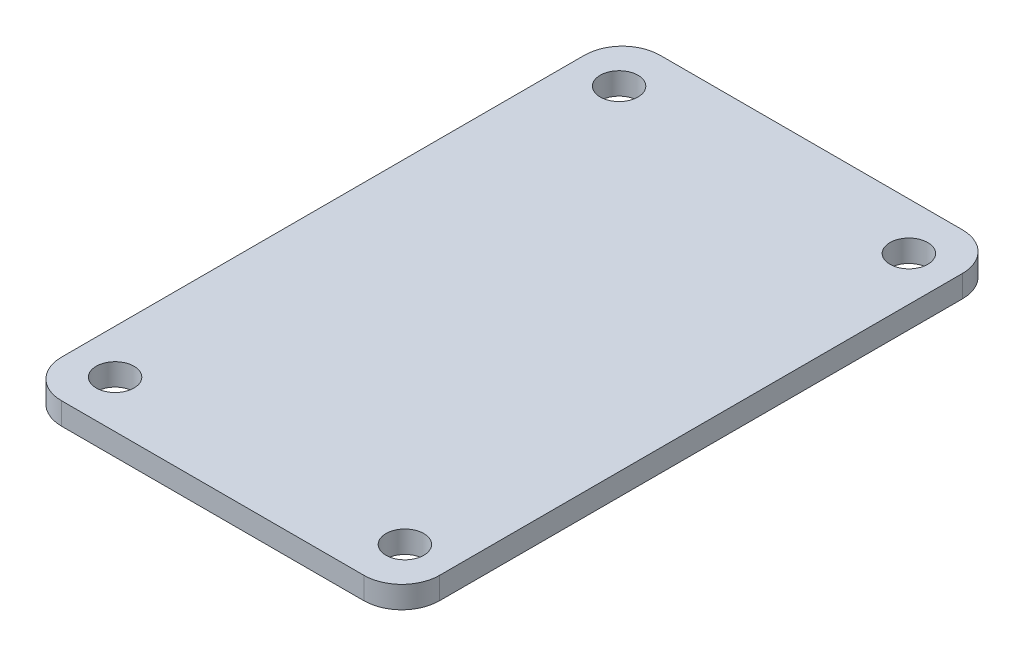
ISO-10303-21;
HEADER;
FILE_DESCRIPTION(('STEP AP214'),'2;1');
FILE_NAME('part.step','',(''),(''),'','','');
FILE_SCHEMA(('AUTOMOTIVE_DESIGN { 1 0 10303 214 1 1 1 1 }'));
ENDSEC;
DATA;
#1=APPLICATION_CONTEXT('core data for automotive mechanical design processes');
#2=APPLICATION_PROTOCOL_DEFINITION('international standard','automotive_design',2000,#1);
#3=PRODUCT_CONTEXT('',#1,'mechanical');
#4=PRODUCT('Part','Part','',(#3));
#5=PRODUCT_RELATED_PRODUCT_CATEGORY('part','',(#4));
#6=PRODUCT_DEFINITION_FORMATION('','',#4);
#7=PRODUCT_DEFINITION_CONTEXT('part definition',#1,'design');
#8=PRODUCT_DEFINITION('design','',#6,#7);
#9=PRODUCT_DEFINITION_SHAPE('','',#8);
#10=(LENGTH_UNIT() NAMED_UNIT(*) SI_UNIT(.MILLI.,.METRE.));
#11=(NAMED_UNIT(*) PLANE_ANGLE_UNIT() SI_UNIT($,.RADIAN.));
#12=(NAMED_UNIT(*) SI_UNIT($,.STERADIAN.) SOLID_ANGLE_UNIT());
#13=UNCERTAINTY_MEASURE_WITH_UNIT(LENGTH_MEASURE(1.E-05),#10,'distance_accuracy_value','');
#14=(GEOMETRIC_REPRESENTATION_CONTEXT(3) GLOBAL_UNCERTAINTY_ASSIGNED_CONTEXT((#13)) GLOBAL_UNIT_ASSIGNED_CONTEXT((#10,
#11,#12)) REPRESENTATION_CONTEXT('',''));
#15=CARTESIAN_POINT('',(0.,0.,0.));
#16=DIRECTION('',(0.,0.,1.));
#17=DIRECTION('',(1.,0.,0.));
#18=AXIS2_PLACEMENT_3D('',#15,#16,#17);
#19=CARTESIAN_POINT('',(-12.,1.75,20.75));
#20=DIRECTION('',(0.,1.,0.));
#21=DIRECTION('',(0.,0.,1.));
#22=AXIS2_PLACEMENT_3D('',#19,#20,#21);
#23=PLANE('',#22);
#24=CARTESIAN_POINT('',(11.5,1.75,20.));
#25=DIRECTION('',(0.,1.,0.));
#26=DIRECTION('',(0.,0.,1.));
#27=AXIS2_PLACEMENT_3D('',#24,#25,#26);
#28=CIRCLE('',#27,1.5);
#29=CARTESIAN_POINT('',(11.5,1.75,21.5));
#30=VERTEX_POINT('',#29);
#31=EDGE_CURVE('E227',#30,#30,#28,.T.);
#32=ORIENTED_EDGE('',*,*,#31,.F.);
#33=EDGE_LOOP('',(#32));
#34=FACE_BOUND('',#33,.T.);
#35=CARTESIAN_POINT('',(-11.5,1.75,-20.));
#36=DIRECTION('',(0.,1.,0.));
#37=DIRECTION('',(0.,0.,1.));
#38=AXIS2_PLACEMENT_3D('',#35,#36,#37);
#39=CIRCLE('',#38,1.5);
#40=CARTESIAN_POINT('',(-11.5,1.75,-18.5));
#41=VERTEX_POINT('',#40);
#42=EDGE_CURVE('E152',#41,#41,#39,.T.);
#43=ORIENTED_EDGE('',*,*,#42,.F.);
#44=EDGE_LOOP('',(#43));
#45=FACE_BOUND('',#44,.T.);
#46=CARTESIAN_POINT('',(-12.,1.75,20.75));
#47=DIRECTION('',(0.,1.,0.));
#48=DIRECTION('',(0.,0.,1.));
#49=AXIS2_PLACEMENT_3D('',#46,#47,#48);
#50=CIRCLE('',#49,3.);
#51=CARTESIAN_POINT('',(-15.,1.75,20.75));
#52=VERTEX_POINT('',#51);
#53=CARTESIAN_POINT('',(-12.,1.75,23.75));
#54=VERTEX_POINT('',#53);
#55=EDGE_CURVE('E170',#52,#54,#50,.T.);
#56=ORIENTED_EDGE('',*,*,#55,.T.);
#57=DIRECTION('',(1.,0.,0.));
#58=VECTOR('',#57,1.);
#59=CARTESIAN_POINT('',(-12.,1.75,23.75));
#60=LINE('',#59,#58);
#61=CARTESIAN_POINT('',(12.,1.75,23.75));
#62=VERTEX_POINT('',#61);
#63=EDGE_CURVE('E106',#54,#62,#60,.T.);
#64=ORIENTED_EDGE('',*,*,#63,.T.);
#65=CARTESIAN_POINT('',(12.,1.75,20.75));
#66=DIRECTION('',(0.,1.,0.));
#67=DIRECTION('',(0.,0.,1.));
#68=AXIS2_PLACEMENT_3D('',#65,#66,#67);
#69=CIRCLE('',#68,3.);
#70=CARTESIAN_POINT('',(15.,1.75,20.75));
#71=VERTEX_POINT('',#70);
#72=EDGE_CURVE('E191',#62,#71,#69,.T.);
#73=ORIENTED_EDGE('',*,*,#72,.T.);
#74=DIRECTION('',(0.,0.,-1.));
#75=VECTOR('',#74,1.);
#76=CARTESIAN_POINT('',(15.,1.75,20.75));
#77=LINE('',#76,#75);
#78=CARTESIAN_POINT('',(15.,1.75,-20.75));
#79=VERTEX_POINT('',#78);
#80=EDGE_CURVE('E205',#71,#79,#77,.T.);
#81=ORIENTED_EDGE('',*,*,#80,.T.);
#82=CARTESIAN_POINT('',(12.,1.75,-20.75));
#83=DIRECTION('',(0.,1.,0.));
#84=DIRECTION('',(0.,0.,1.));
#85=AXIS2_PLACEMENT_3D('',#82,#83,#84);
#86=CIRCLE('',#85,3.);
#87=CARTESIAN_POINT('',(12.,1.75,-23.75));
#88=VERTEX_POINT('',#87);
#89=EDGE_CURVE('E125',#79,#88,#86,.T.);
#90=ORIENTED_EDGE('',*,*,#89,.T.);
#91=DIRECTION('',(-1.,0.,0.));
#92=VECTOR('',#91,1.);
#93=CARTESIAN_POINT('',(-12.,1.75,-23.75));
#94=LINE('',#93,#92);
#95=CARTESIAN_POINT('',(-12.,1.75,-23.75));
#96=VERTEX_POINT('',#95);
#97=EDGE_CURVE('E119',#88,#96,#94,.T.);
#98=ORIENTED_EDGE('',*,*,#97,.T.);
#99=CARTESIAN_POINT('',(-12.,1.75,-20.75));
#100=DIRECTION('',(0.,1.,0.));
#101=DIRECTION('',(0.,0.,1.));
#102=AXIS2_PLACEMENT_3D('',#99,#100,#101);
#103=CIRCLE('',#102,3.);
#104=CARTESIAN_POINT('',(-15.,1.75,-20.75));
#105=VERTEX_POINT('',#104);
#106=EDGE_CURVE('E123',#96,#105,#103,.T.);
#107=ORIENTED_EDGE('',*,*,#106,.T.);
#108=DIRECTION('',(0.,0.,1.));
#109=VECTOR('',#108,1.);
#110=CARTESIAN_POINT('',(-15.,1.75,20.75));
#111=LINE('',#110,#109);
#112=EDGE_CURVE('E63',#105,#52,#111,.T.);
#113=ORIENTED_EDGE('',*,*,#112,.T.);
#114=EDGE_LOOP('',(#56,#64,#73,#81,#90,#98,#107,#113));
#115=FACE_BOUND('',#114,.T.);
#116=CARTESIAN_POINT('',(11.5,1.75,-20.));
#117=DIRECTION('',(0.,1.,0.));
#118=DIRECTION('',(0.,0.,1.));
#119=AXIS2_PLACEMENT_3D('',#116,#117,#118);
#120=CIRCLE('',#119,1.5);
#121=CARTESIAN_POINT('',(11.5,1.75,-18.5));
#122=VERTEX_POINT('',#121);
#123=EDGE_CURVE('E219',#122,#122,#120,.T.);
#124=ORIENTED_EDGE('',*,*,#123,.F.);
#125=EDGE_LOOP('',(#124));
#126=FACE_BOUND('',#125,.T.);
#127=CARTESIAN_POINT('',(-11.5,1.75,20.));
#128=DIRECTION('',(0.,1.,0.));
#129=DIRECTION('',(0.,0.,1.));
#130=AXIS2_PLACEMENT_3D('',#127,#128,#129);
#131=CIRCLE('',#130,1.5);
#132=CARTESIAN_POINT('',(-11.5,1.75,21.5));
#133=VERTEX_POINT('',#132);
#134=EDGE_CURVE('E235',#133,#133,#131,.T.);
#135=ORIENTED_EDGE('',*,*,#134,.F.);
#136=EDGE_LOOP('',(#135));
#137=FACE_BOUND('',#136,.T.);
#138=ADVANCED_FACE('F45',(#34,#45,#115,#126,#137),#23,.T.);
#139=CARTESIAN_POINT('',(-12.,0.,20.75));
#140=DIRECTION('',(0.,1.,0.));
#141=DIRECTION('',(0.,0.,1.));
#142=AXIS2_PLACEMENT_3D('',#139,#140,#141);
#143=PLANE('',#142);
#144=CARTESIAN_POINT('',(-12.,0.,20.75));
#145=DIRECTION('',(0.,1.,0.));
#146=DIRECTION('',(0.,0.,1.));
#147=AXIS2_PLACEMENT_3D('',#144,#145,#146);
#148=CIRCLE('',#147,3.);
#149=CARTESIAN_POINT('',(-15.,0.,20.75));
#150=VERTEX_POINT('',#149);
#151=CARTESIAN_POINT('',(-12.,0.,23.75));
#152=VERTEX_POINT('',#151);
#153=EDGE_CURVE('E147',#150,#152,#148,.T.);
#154=ORIENTED_EDGE('',*,*,#153,.F.);
#155=DIRECTION('',(0.,0.,1.));
#156=VECTOR('',#155,1.);
#157=CARTESIAN_POINT('',(-15.,0.,20.75));
#158=LINE('',#157,#156);
#159=CARTESIAN_POINT('',(-15.,0.,-20.75));
#160=VERTEX_POINT('',#159);
#161=EDGE_CURVE('E98',#160,#150,#158,.T.);
#162=ORIENTED_EDGE('',*,*,#161,.F.);
#163=CARTESIAN_POINT('',(-12.,0.,-20.75));
#164=DIRECTION('',(0.,1.,0.));
#165=DIRECTION('',(0.,0.,1.));
#166=AXIS2_PLACEMENT_3D('',#163,#164,#165);
#167=CIRCLE('',#166,3.);
#168=CARTESIAN_POINT('',(-12.,0.,-23.75));
#169=VERTEX_POINT('',#168);
#170=EDGE_CURVE('E92',#169,#160,#167,.T.);
#171=ORIENTED_EDGE('',*,*,#170,.F.);
#172=DIRECTION('',(-1.,0.,0.));
#173=VECTOR('',#172,1.);
#174=CARTESIAN_POINT('',(-12.,0.,-23.75));
#175=LINE('',#174,#173);
#176=CARTESIAN_POINT('',(12.,0.,-23.75));
#177=VERTEX_POINT('',#176);
#178=EDGE_CURVE('E134',#177,#169,#175,.T.);
#179=ORIENTED_EDGE('',*,*,#178,.F.);
#180=CARTESIAN_POINT('',(12.,0.,-20.75));
#181=DIRECTION('',(0.,1.,0.));
#182=DIRECTION('',(0.,0.,1.));
#183=AXIS2_PLACEMENT_3D('',#180,#181,#182);
#184=CIRCLE('',#183,3.);
#185=CARTESIAN_POINT('',(15.,0.,-20.75));
#186=VERTEX_POINT('',#185);
#187=EDGE_CURVE('E161',#186,#177,#184,.T.);
#188=ORIENTED_EDGE('',*,*,#187,.F.);
#189=DIRECTION('',(0.,0.,-1.));
#190=VECTOR('',#189,1.);
#191=CARTESIAN_POINT('',(15.,0.,20.75));
#192=LINE('',#191,#190);
#193=CARTESIAN_POINT('',(15.,0.,20.75));
#194=VERTEX_POINT('',#193);
#195=EDGE_CURVE('E158',#194,#186,#192,.T.);
#196=ORIENTED_EDGE('',*,*,#195,.F.);
#197=CARTESIAN_POINT('',(12.,0.,20.75));
#198=DIRECTION('',(0.,1.,0.));
#199=DIRECTION('',(0.,0.,1.));
#200=AXIS2_PLACEMENT_3D('',#197,#198,#199);
#201=CIRCLE('',#200,3.);
#202=CARTESIAN_POINT('',(12.,0.,23.75));
#203=VERTEX_POINT('',#202);
#204=EDGE_CURVE('E155',#203,#194,#201,.T.);
#205=ORIENTED_EDGE('',*,*,#204,.F.);
#206=DIRECTION('',(1.,0.,0.));
#207=VECTOR('',#206,1.);
#208=CARTESIAN_POINT('',(-12.,0.,23.75));
#209=LINE('',#208,#207);
#210=EDGE_CURVE('E151',#152,#203,#209,.T.);
#211=ORIENTED_EDGE('',*,*,#210,.F.);
#212=EDGE_LOOP('',(#154,#162,#171,#179,#188,#196,#205,#211));
#213=FACE_BOUND('',#212,.T.);
#214=CARTESIAN_POINT('',(-11.5,0.,-20.));
#215=DIRECTION('',(0.,1.,0.));
#216=DIRECTION('',(0.,0.,1.));
#217=AXIS2_PLACEMENT_3D('',#214,#215,#216);
#218=CIRCLE('',#217,1.5);
#219=CARTESIAN_POINT('',(-11.5,0.,-18.5));
#220=VERTEX_POINT('',#219);
#221=EDGE_CURVE('E215',#220,#220,#218,.T.);
#222=ORIENTED_EDGE('',*,*,#221,.T.);
#223=EDGE_LOOP('',(#222));
#224=FACE_BOUND('',#223,.T.);
#225=CARTESIAN_POINT('',(11.5,0.,-20.));
#226=DIRECTION('',(0.,1.,0.));
#227=DIRECTION('',(0.,0.,1.));
#228=AXIS2_PLACEMENT_3D('',#225,#226,#227);
#229=CIRCLE('',#228,1.5);
#230=CARTESIAN_POINT('',(11.5,0.,-18.5));
#231=VERTEX_POINT('',#230);
#232=EDGE_CURVE('E223',#231,#231,#229,.T.);
#233=ORIENTED_EDGE('',*,*,#232,.T.);
#234=EDGE_LOOP('',(#233));
#235=FACE_BOUND('',#234,.T.);
#236=CARTESIAN_POINT('',(11.5,0.,20.));
#237=DIRECTION('',(0.,1.,0.));
#238=DIRECTION('',(0.,0.,1.));
#239=AXIS2_PLACEMENT_3D('',#236,#237,#238);
#240=CIRCLE('',#239,1.5);
#241=CARTESIAN_POINT('',(11.5,0.,21.5));
#242=VERTEX_POINT('',#241);
#243=EDGE_CURVE('E231',#242,#242,#240,.T.);
#244=ORIENTED_EDGE('',*,*,#243,.T.);
#245=EDGE_LOOP('',(#244));
#246=FACE_BOUND('',#245,.T.);
#247=CARTESIAN_POINT('',(-11.5,0.,20.));
#248=DIRECTION('',(0.,1.,0.));
#249=DIRECTION('',(0.,0.,1.));
#250=AXIS2_PLACEMENT_3D('',#247,#248,#249);
#251=CIRCLE('',#250,1.5);
#252=CARTESIAN_POINT('',(-11.5,0.,21.5));
#253=VERTEX_POINT('',#252);
#254=EDGE_CURVE('E239',#253,#253,#251,.T.);
#255=ORIENTED_EDGE('',*,*,#254,.T.);
#256=EDGE_LOOP('',(#255));
#257=FACE_BOUND('',#256,.T.);
#258=ADVANCED_FACE('F195',(#213,#224,#235,#246,#257),#143,.F.);
#259=CARTESIAN_POINT('',(-12.,1.75,20.75));
#260=DIRECTION('',(0.,-1.,0.));
#261=DIRECTION('',(0.,0.,-1.));
#262=AXIS2_PLACEMENT_3D('',#259,#260,#261);
#263=CYLINDRICAL_SURFACE('',#262,3.);
#264=ORIENTED_EDGE('',*,*,#153,.T.);
#265=DIRECTION('',(0.,-1.,0.));
#266=VECTOR('',#265,1.);
#267=CARTESIAN_POINT('',(-12.,1.75,23.75));
#268=LINE('',#267,#266);
#269=EDGE_CURVE('E11',#54,#152,#268,.T.);
#270=ORIENTED_EDGE('',*,*,#269,.F.);
#271=ORIENTED_EDGE('',*,*,#55,.F.);
#272=DIRECTION('',(0.,-1.,0.));
#273=VECTOR('',#272,1.);
#274=CARTESIAN_POINT('',(-15.,1.75,20.75));
#275=LINE('',#274,#273);
#276=EDGE_CURVE('E143',#52,#150,#275,.T.);
#277=ORIENTED_EDGE('',*,*,#276,.T.);
#278=EDGE_LOOP('',(#264,#270,#271,#277));
#279=FACE_BOUND('',#278,.T.);
#280=ADVANCED_FACE('F47',(#279),#263,.T.);
#281=CARTESIAN_POINT('',(-12.,1.75,23.75));
#282=DIRECTION('',(0.,0.,-1.));
#283=DIRECTION('',(-1.,0.,0.));
#284=AXIS2_PLACEMENT_3D('',#281,#282,#283);
#285=PLANE('',#284);
#286=ORIENTED_EDGE('',*,*,#210,.T.);
#287=DIRECTION('',(0.,-1.,0.));
#288=VECTOR('',#287,1.);
#289=CARTESIAN_POINT('',(12.,1.75,23.75));
#290=LINE('',#289,#288);
#291=EDGE_CURVE('E55',#62,#203,#290,.T.);
#292=ORIENTED_EDGE('',*,*,#291,.F.);
#293=ORIENTED_EDGE('',*,*,#63,.F.);
#294=ORIENTED_EDGE('',*,*,#269,.T.);
#295=EDGE_LOOP('',(#286,#292,#293,#294));
#296=FACE_BOUND('',#295,.T.);
#297=ADVANCED_FACE('F275',(#296),#285,.F.);
#298=CARTESIAN_POINT('',(12.,1.75,20.75));
#299=DIRECTION('',(0.,-1.,0.));
#300=DIRECTION('',(0.,0.,-1.));
#301=AXIS2_PLACEMENT_3D('',#298,#299,#300);
#302=CYLINDRICAL_SURFACE('',#301,3.);
#303=ORIENTED_EDGE('',*,*,#204,.T.);
#304=DIRECTION('',(0.,-1.,0.));
#305=VECTOR('',#304,1.);
#306=CARTESIAN_POINT('',(15.,1.75,20.75));
#307=LINE('',#306,#305);
#308=EDGE_CURVE('E181',#71,#194,#307,.T.);
#309=ORIENTED_EDGE('',*,*,#308,.F.);
#310=ORIENTED_EDGE('',*,*,#72,.F.);
#311=ORIENTED_EDGE('',*,*,#291,.T.);
#312=EDGE_LOOP('',(#303,#309,#310,#311));
#313=FACE_BOUND('',#312,.T.);
#314=ADVANCED_FACE('F189',(#313),#302,.T.);
#315=CARTESIAN_POINT('',(15.,1.75,20.75));
#316=DIRECTION('',(-1.,0.,0.));
#317=DIRECTION('',(0.,0.,1.));
#318=AXIS2_PLACEMENT_3D('',#315,#316,#317);
#319=PLANE('',#318);
#320=ORIENTED_EDGE('',*,*,#195,.T.);
#321=DIRECTION('',(0.,-1.,0.));
#322=VECTOR('',#321,1.);
#323=CARTESIAN_POINT('',(15.,1.75,-20.75));
#324=LINE('',#323,#322);
#325=EDGE_CURVE('E177',#79,#186,#324,.T.);
#326=ORIENTED_EDGE('',*,*,#325,.F.);
#327=ORIENTED_EDGE('',*,*,#80,.F.);
#328=ORIENTED_EDGE('',*,*,#308,.T.);
#329=EDGE_LOOP('',(#320,#326,#327,#328));
#330=FACE_BOUND('',#329,.T.);
#331=ADVANCED_FACE('F200',(#330),#319,.F.);
#332=CARTESIAN_POINT('',(12.,1.75,-20.75));
#333=DIRECTION('',(0.,-1.,0.));
#334=DIRECTION('',(0.,0.,-1.));
#335=AXIS2_PLACEMENT_3D('',#332,#333,#334);
#336=CYLINDRICAL_SURFACE('',#335,3.);
#337=ORIENTED_EDGE('',*,*,#187,.T.);
#338=DIRECTION('',(0.,-1.,0.));
#339=VECTOR('',#338,1.);
#340=CARTESIAN_POINT('',(12.,1.75,-23.75));
#341=LINE('',#340,#339);
#342=EDGE_CURVE('E136',#88,#177,#341,.T.);
#343=ORIENTED_EDGE('',*,*,#342,.F.);
#344=ORIENTED_EDGE('',*,*,#89,.F.);
#345=ORIENTED_EDGE('',*,*,#325,.T.);
#346=EDGE_LOOP('',(#337,#343,#344,#345));
#347=FACE_BOUND('',#346,.T.);
#348=ADVANCED_FACE('F203',(#347),#336,.T.);
#349=CARTESIAN_POINT('',(-12.,1.75,-23.75));
#350=DIRECTION('',(0.,0.,1.));
#351=DIRECTION('',(1.,0.,0.));
#352=AXIS2_PLACEMENT_3D('',#349,#350,#351);
#353=PLANE('',#352);
#354=ORIENTED_EDGE('',*,*,#178,.T.);
#355=DIRECTION('',(0.,-1.,0.));
#356=VECTOR('',#355,1.);
#357=CARTESIAN_POINT('',(-12.,1.75,-23.75));
#358=LINE('',#357,#356);
#359=EDGE_CURVE('E131',#96,#169,#358,.T.);
#360=ORIENTED_EDGE('',*,*,#359,.F.);
#361=ORIENTED_EDGE('',*,*,#97,.F.);
#362=ORIENTED_EDGE('',*,*,#342,.T.);
#363=EDGE_LOOP('',(#354,#360,#361,#362));
#364=FACE_BOUND('',#363,.T.);
#365=ADVANCED_FACE('F132',(#364),#353,.F.);
#366=CARTESIAN_POINT('',(-12.,1.75,-20.75));
#367=DIRECTION('',(0.,-1.,0.));
#368=DIRECTION('',(0.,0.,-1.));
#369=AXIS2_PLACEMENT_3D('',#366,#367,#368);
#370=CYLINDRICAL_SURFACE('',#369,3.);
#371=ORIENTED_EDGE('',*,*,#170,.T.);
#372=DIRECTION('',(0.,-1.,0.));
#373=VECTOR('',#372,1.);
#374=CARTESIAN_POINT('',(-15.,1.75,-20.75));
#375=LINE('',#374,#373);
#376=EDGE_CURVE('E137',#105,#160,#375,.T.);
#377=ORIENTED_EDGE('',*,*,#376,.F.);
#378=ORIENTED_EDGE('',*,*,#106,.F.);
#379=ORIENTED_EDGE('',*,*,#359,.T.);
#380=EDGE_LOOP('',(#371,#377,#378,#379));
#381=FACE_BOUND('',#380,.T.);
#382=ADVANCED_FACE('F139',(#381),#370,.T.);
#383=CARTESIAN_POINT('',(-15.,1.75,20.75));
#384=DIRECTION('',(1.,0.,0.));
#385=DIRECTION('',(0.,0.,-1.));
#386=AXIS2_PLACEMENT_3D('',#383,#384,#385);
#387=PLANE('',#386);
#388=ORIENTED_EDGE('',*,*,#161,.T.);
#389=ORIENTED_EDGE('',*,*,#276,.F.);
#390=ORIENTED_EDGE('',*,*,#112,.F.);
#391=ORIENTED_EDGE('',*,*,#376,.T.);
#392=EDGE_LOOP('',(#388,#389,#390,#391));
#393=FACE_BOUND('',#392,.T.);
#394=ADVANCED_FACE('F263',(#393),#387,.F.);
#395=CARTESIAN_POINT('',(-11.5,1.75,-20.));
#396=DIRECTION('',(0.,-1.,0.));
#397=DIRECTION('',(0.,0.,-1.));
#398=AXIS2_PLACEMENT_3D('',#395,#396,#397);
#399=CYLINDRICAL_SURFACE('',#398,1.5);
#400=ORIENTED_EDGE('',*,*,#42,.T.);
#401=EDGE_LOOP('',(#400));
#402=FACE_BOUND('',#401,.T.);
#403=ORIENTED_EDGE('',*,*,#221,.F.);
#404=EDGE_LOOP('',(#403));
#405=FACE_BOUND('',#404,.T.);
#406=ADVANCED_FACE('F260',(#402,#405),#399,.F.);
#407=CARTESIAN_POINT('',(11.5,1.75,-20.));
#408=DIRECTION('',(0.,-1.,0.));
#409=DIRECTION('',(0.,0.,-1.));
#410=AXIS2_PLACEMENT_3D('',#407,#408,#409);
#411=CYLINDRICAL_SURFACE('',#410,1.5);
#412=ORIENTED_EDGE('',*,*,#123,.T.);
#413=EDGE_LOOP('',(#412));
#414=FACE_BOUND('',#413,.T.);
#415=ORIENTED_EDGE('',*,*,#232,.F.);
#416=EDGE_LOOP('',(#415));
#417=FACE_BOUND('',#416,.T.);
#418=ADVANCED_FACE('F338',(#414,#417),#411,.F.);
#419=CARTESIAN_POINT('',(11.5,1.75,20.));
#420=DIRECTION('',(0.,-1.,0.));
#421=DIRECTION('',(0.,0.,-1.));
#422=AXIS2_PLACEMENT_3D('',#419,#420,#421);
#423=CYLINDRICAL_SURFACE('',#422,1.5);
#424=ORIENTED_EDGE('',*,*,#31,.T.);
#425=EDGE_LOOP('',(#424));
#426=FACE_BOUND('',#425,.T.);
#427=ORIENTED_EDGE('',*,*,#243,.F.);
#428=EDGE_LOOP('',(#427));
#429=FACE_BOUND('',#428,.T.);
#430=ADVANCED_FACE('F346',(#426,#429),#423,.F.);
#431=CARTESIAN_POINT('',(-11.5,1.75,20.));
#432=DIRECTION('',(0.,-1.,0.));
#433=DIRECTION('',(0.,0.,-1.));
#434=AXIS2_PLACEMENT_3D('',#431,#432,#433);
#435=CYLINDRICAL_SURFACE('',#434,1.5);
#436=ORIENTED_EDGE('',*,*,#134,.T.);
#437=EDGE_LOOP('',(#436));
#438=FACE_BOUND('',#437,.T.);
#439=ORIENTED_EDGE('',*,*,#254,.F.);
#440=EDGE_LOOP('',(#439));
#441=FACE_BOUND('',#440,.T.);
#442=ADVANCED_FACE('F247',(#438,#441),#435,.F.);
#443=CLOSED_SHELL('',(#138,#258,#280,#297,#314,#331,#348,#365,#382,#394,#406,#418,#430,#442));
#444=MANIFOLD_SOLID_BREP('B2',#443);
#445=ADVANCED_BREP_SHAPE_REPRESENTATION('',(#18,#444),#14);
#446=SHAPE_DEFINITION_REPRESENTATION(#9,#445);
ENDSEC;
END-ISO-10303-21;
